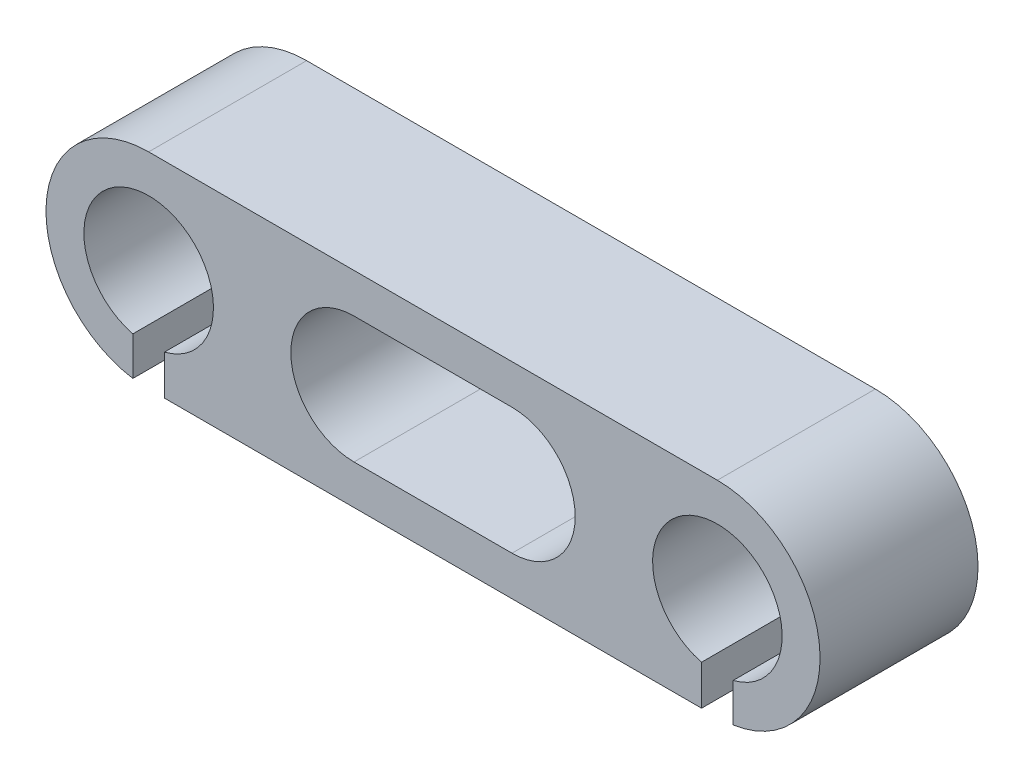
ISO-10303-21;
HEADER;
FILE_DESCRIPTION(('STEP AP214'),'2;1');
FILE_NAME('part.step','',(''),(''),'','','');
FILE_SCHEMA(('AUTOMOTIVE_DESIGN { 1 0 10303 214 1 1 1 1 }'));
ENDSEC;
DATA;
#1=APPLICATION_CONTEXT('core data for automotive mechanical design processes');
#2=APPLICATION_PROTOCOL_DEFINITION('international standard','automotive_design',2000,#1);
#3=PRODUCT_CONTEXT('',#1,'mechanical');
#4=PRODUCT('Part','Part','',(#3));
#5=PRODUCT_RELATED_PRODUCT_CATEGORY('part','',(#4));
#6=PRODUCT_DEFINITION_FORMATION('','',#4);
#7=PRODUCT_DEFINITION_CONTEXT('part definition',#1,'design');
#8=PRODUCT_DEFINITION('design','',#6,#7);
#9=PRODUCT_DEFINITION_SHAPE('','',#8);
#10=(LENGTH_UNIT() NAMED_UNIT(*) SI_UNIT(.MILLI.,.METRE.));
#11=(NAMED_UNIT(*) PLANE_ANGLE_UNIT() SI_UNIT($,.RADIAN.));
#12=(NAMED_UNIT(*) SI_UNIT($,.STERADIAN.) SOLID_ANGLE_UNIT());
#13=UNCERTAINTY_MEASURE_WITH_UNIT(LENGTH_MEASURE(1.E-05),#10,'distance_accuracy_value','');
#14=(GEOMETRIC_REPRESENTATION_CONTEXT(3) GLOBAL_UNCERTAINTY_ASSIGNED_CONTEXT((#13)) GLOBAL_UNIT_ASSIGNED_CONTEXT((#10,
#11,#12)) REPRESENTATION_CONTEXT('',''));
#15=CARTESIAN_POINT('',(0.,0.,0.));
#16=DIRECTION('',(0.,0.,1.));
#17=DIRECTION('',(1.,0.,0.));
#18=AXIS2_PLACEMENT_3D('',#15,#16,#17);
#19=CARTESIAN_POINT('',(18.,0.,5.));
#20=DIRECTION('',(0.,0.,-1.));
#21=DIRECTION('',(-1.,0.,0.));
#22=AXIS2_PLACEMENT_3D('',#19,#20,#21);
#23=CYLINDRICAL_SURFACE('',#22,3.25);
#24=DIRECTION('',(0.,0.,-1.));
#25=VECTOR('',#24,1.);
#26=CARTESIAN_POINT('',(18.5,-3.21130814466628,5.));
#27=LINE('',#26,#25);
#28=CARTESIAN_POINT('',(18.5,-3.21130814466628,0.));
#29=VERTEX_POINT('',#28);
#30=CARTESIAN_POINT('',(18.5,-3.21130814466628,5.));
#31=VERTEX_POINT('',#30);
#32=EDGE_CURVE('E397',#29,#31,#27,.F.);
#33=ORIENTED_EDGE('',*,*,#32,.F.);
#34=CARTESIAN_POINT('',(18.,0.,0.));
#35=DIRECTION('',(0.,0.,1.));
#36=DIRECTION('',(1.,0.,0.));
#37=AXIS2_PLACEMENT_3D('',#34,#35,#36);
#38=CIRCLE('',#37,3.25);
#39=CARTESIAN_POINT('',(18.,3.25,0.));
#40=VERTEX_POINT('',#39);
#41=EDGE_CURVE('E155',#29,#40,#38,.T.);
#42=ORIENTED_EDGE('',*,*,#41,.T.);
#43=DIRECTION('',(0.,0.,-1.));
#44=VECTOR('',#43,1.);
#45=CARTESIAN_POINT('',(18.,3.25,5.));
#46=LINE('',#45,#44);
#47=CARTESIAN_POINT('',(18.,3.25,5.));
#48=VERTEX_POINT('',#47);
#49=EDGE_CURVE('E170',#48,#40,#46,.T.);
#50=ORIENTED_EDGE('',*,*,#49,.F.);
#51=CARTESIAN_POINT('',(18.,0.,5.));
#52=DIRECTION('',(0.,0.,1.));
#53=DIRECTION('',(1.,0.,0.));
#54=AXIS2_PLACEMENT_3D('',#51,#52,#53);
#55=CIRCLE('',#54,3.25);
#56=EDGE_CURVE('E202',#31,#48,#55,.T.);
#57=ORIENTED_EDGE('',*,*,#56,.F.);
#58=EDGE_LOOP('',(#33,#42,#50,#57));
#59=FACE_BOUND('',#58,.T.);
#60=ADVANCED_FACE('F33',(#59),#23,.T.);
#61=CARTESIAN_POINT('',(0.,-3.25,5.));
#62=DIRECTION('',(0.,1.,0.));
#63=DIRECTION('',(-1.,0.,0.));
#64=AXIS2_PLACEMENT_3D('',#61,#62,#63);
#65=PLANE('',#64);
#66=DIRECTION('',(1.,0.,0.));
#67=VECTOR('',#66,1.);
#68=CARTESIAN_POINT('',(0.,-3.25,0.));
#69=LINE('',#68,#67);
#70=CARTESIAN_POINT('',(0.5,-3.25,0.));
#71=VERTEX_POINT('',#70);
#72=CARTESIAN_POINT('',(17.5,-3.25,0.));
#73=VERTEX_POINT('',#72);
#74=EDGE_CURVE('E146',#71,#73,#69,.T.);
#75=ORIENTED_EDGE('',*,*,#74,.T.);
#76=DIRECTION('',(0.,0.,-1.));
#77=VECTOR('',#76,1.);
#78=CARTESIAN_POINT('',(17.5,-3.25,5.));
#79=LINE('',#78,#77);
#80=CARTESIAN_POINT('',(17.5,-3.25,5.));
#81=VERTEX_POINT('',#80);
#82=EDGE_CURVE('E131',#81,#73,#79,.T.);
#83=ORIENTED_EDGE('',*,*,#82,.F.);
#84=DIRECTION('',(1.,0.,0.));
#85=VECTOR('',#84,1.);
#86=CARTESIAN_POINT('',(0.,-3.25,5.));
#87=LINE('',#86,#85);
#88=CARTESIAN_POINT('',(0.5,-3.25,5.));
#89=VERTEX_POINT('',#88);
#90=EDGE_CURVE('E200',#89,#81,#87,.T.);
#91=ORIENTED_EDGE('',*,*,#90,.F.);
#92=DIRECTION('',(0.,0.,-1.));
#93=VECTOR('',#92,1.);
#94=CARTESIAN_POINT('',(0.5,-3.25,5.));
#95=LINE('',#94,#93);
#96=EDGE_CURVE('E154',#89,#71,#95,.T.);
#97=ORIENTED_EDGE('',*,*,#96,.T.);
#98=EDGE_LOOP('',(#75,#83,#91,#97));
#99=FACE_BOUND('',#98,.T.);
#100=ADVANCED_FACE('F153',(#99),#65,.F.);
#101=CARTESIAN_POINT('',(0.,0.,5.));
#102=DIRECTION('',(0.,0.,1.));
#103=DIRECTION('',(1.,0.,0.));
#104=AXIS2_PLACEMENT_3D('',#101,#102,#103);
#105=PLANE('',#104);
#106=DIRECTION('',(0.,-1.,0.));
#107=VECTOR('',#106,1.);
#108=CARTESIAN_POINT('',(17.5,-1.25,5.));
#109=LINE('',#108,#107);
#110=CARTESIAN_POINT('',(17.5,-1.9880895352071,5.));
#111=VERTEX_POINT('',#110);
#112=EDGE_CURVE('E134',#111,#81,#109,.T.);
#113=ORIENTED_EDGE('',*,*,#112,.F.);
#114=CARTESIAN_POINT('',(18.,0.,5.));
#115=DIRECTION('',(0.,0.,1.));
#116=DIRECTION('',(1.,0.,0.));
#117=AXIS2_PLACEMENT_3D('',#114,#115,#116);
#118=CIRCLE('',#117,2.05);
#119=CARTESIAN_POINT('',(18.5,-1.9880895352071,5.));
#120=VERTEX_POINT('',#119);
#121=EDGE_CURVE('E182',#120,#111,#118,.T.);
#122=ORIENTED_EDGE('',*,*,#121,.F.);
#123=DIRECTION('',(0.,-1.,0.));
#124=VECTOR('',#123,1.);
#125=CARTESIAN_POINT('',(18.5,-1.25,5.));
#126=LINE('',#125,#124);
#127=EDGE_CURVE('E55',#120,#31,#126,.T.);
#128=ORIENTED_EDGE('',*,*,#127,.T.);
#129=ORIENTED_EDGE('',*,*,#56,.T.);
#130=DIRECTION('',(-1.,0.,0.));
#131=VECTOR('',#130,1.);
#132=CARTESIAN_POINT('',(0.,3.25,5.));
#133=LINE('',#132,#131);
#134=CARTESIAN_POINT('',(0.,3.25,5.));
#135=VERTEX_POINT('',#134);
#136=EDGE_CURVE('E171',#48,#135,#133,.T.);
#137=ORIENTED_EDGE('',*,*,#136,.T.);
#138=CARTESIAN_POINT('',(0.,0.,5.));
#139=DIRECTION('',(0.,0.,1.));
#140=DIRECTION('',(1.,0.,0.));
#141=AXIS2_PLACEMENT_3D('',#138,#139,#140);
#142=CIRCLE('',#141,3.25);
#143=CARTESIAN_POINT('',(-0.5,-3.21130814466628,5.));
#144=VERTEX_POINT('',#143);
#145=EDGE_CURVE('E166',#135,#144,#142,.T.);
#146=ORIENTED_EDGE('',*,*,#145,.T.);
#147=DIRECTION('',(0.,-1.,0.));
#148=VECTOR('',#147,1.);
#149=CARTESIAN_POINT('',(-0.5,-1.25,5.));
#150=LINE('',#149,#148);
#151=CARTESIAN_POINT('',(-0.5,-1.9880895352071,5.));
#152=VERTEX_POINT('',#151);
#153=EDGE_CURVE('E218',#152,#144,#150,.T.);
#154=ORIENTED_EDGE('',*,*,#153,.F.);
#155=CARTESIAN_POINT('',(0.,0.,5.));
#156=DIRECTION('',(0.,0.,1.));
#157=DIRECTION('',(1.,0.,0.));
#158=AXIS2_PLACEMENT_3D('',#155,#156,#157);
#159=CIRCLE('',#158,2.05);
#160=CARTESIAN_POINT('',(0.5,-1.9880895352071,5.));
#161=VERTEX_POINT('',#160);
#162=EDGE_CURVE('E161',#161,#152,#159,.T.);
#163=ORIENTED_EDGE('',*,*,#162,.F.);
#164=DIRECTION('',(0.,-1.,0.));
#165=VECTOR('',#164,1.);
#166=CARTESIAN_POINT('',(0.5,-1.25,5.));
#167=LINE('',#166,#165);
#168=EDGE_CURVE('E223',#161,#89,#167,.T.);
#169=ORIENTED_EDGE('',*,*,#168,.T.);
#170=ORIENTED_EDGE('',*,*,#90,.T.);
#171=EDGE_LOOP('',(#113,#122,#128,#129,#137,#146,#154,#163,#169,#170));
#172=FACE_BOUND('',#171,.T.);
#173=DIRECTION('',(-1.,0.,0.));
#174=VECTOR('',#173,1.);
#175=CARTESIAN_POINT('',(11.5,2.,5.));
#176=LINE('',#175,#174);
#177=CARTESIAN_POINT('',(11.5,2.,5.));
#178=VERTEX_POINT('',#177);
#179=CARTESIAN_POINT('',(6.5,2.,5.));
#180=VERTEX_POINT('',#179);
#181=EDGE_CURVE('E231',#178,#180,#176,.T.);
#182=ORIENTED_EDGE('',*,*,#181,.F.);
#183=CARTESIAN_POINT('',(11.5,0.,5.));
#184=DIRECTION('',(0.,0.,1.));
#185=DIRECTION('',(1.,0.,0.));
#186=AXIS2_PLACEMENT_3D('',#183,#184,#185);
#187=CIRCLE('',#186,2.);
#188=CARTESIAN_POINT('',(11.5,-2.,5.));
#189=VERTEX_POINT('',#188);
#190=EDGE_CURVE('E229',#189,#178,#187,.T.);
#191=ORIENTED_EDGE('',*,*,#190,.F.);
#192=DIRECTION('',(1.,0.,0.));
#193=VECTOR('',#192,1.);
#194=CARTESIAN_POINT('',(11.5,-2.,5.));
#195=LINE('',#194,#193);
#196=CARTESIAN_POINT('',(6.5,-2.,5.));
#197=VERTEX_POINT('',#196);
#198=EDGE_CURVE('E237',#197,#189,#195,.T.);
#199=ORIENTED_EDGE('',*,*,#198,.F.);
#200=CARTESIAN_POINT('',(6.5,0.,5.));
#201=DIRECTION('',(0.,0.,1.));
#202=DIRECTION('',(1.,0.,0.));
#203=AXIS2_PLACEMENT_3D('',#200,#201,#202);
#204=CIRCLE('',#203,2.);
#205=EDGE_CURVE('E234',#180,#197,#204,.T.);
#206=ORIENTED_EDGE('',*,*,#205,.F.);
#207=EDGE_LOOP('',(#182,#191,#199,#206));
#208=FACE_BOUND('',#207,.T.);
#209=ADVANCED_FACE('F184',(#172,#208),#105,.T.);
#210=CARTESIAN_POINT('',(0.,0.,0.));
#211=DIRECTION('',(0.,0.,1.));
#212=DIRECTION('',(1.,0.,0.));
#213=AXIS2_PLACEMENT_3D('',#210,#211,#212);
#214=PLANE('',#213);
#215=CARTESIAN_POINT('',(18.,0.,0.));
#216=DIRECTION('',(0.,0.,1.));
#217=DIRECTION('',(1.,0.,0.));
#218=AXIS2_PLACEMENT_3D('',#215,#216,#217);
#219=CIRCLE('',#218,2.05);
#220=CARTESIAN_POINT('',(18.5,-1.9880895352071,0.));
#221=VERTEX_POINT('',#220);
#222=CARTESIAN_POINT('',(17.5,-1.9880895352071,0.));
#223=VERTEX_POINT('',#222);
#224=EDGE_CURVE('E149',#221,#223,#219,.T.);
#225=ORIENTED_EDGE('',*,*,#224,.T.);
#226=DIRECTION('',(0.,-1.,0.));
#227=VECTOR('',#226,1.);
#228=CARTESIAN_POINT('',(17.5,-1.25,0.));
#229=LINE('',#228,#227);
#230=EDGE_CURVE('E47',#223,#73,#229,.T.);
#231=ORIENTED_EDGE('',*,*,#230,.T.);
#232=ORIENTED_EDGE('',*,*,#74,.F.);
#233=DIRECTION('',(0.,-1.,0.));
#234=VECTOR('',#233,1.);
#235=CARTESIAN_POINT('',(0.5,-1.25,0.));
#236=LINE('',#235,#234);
#237=CARTESIAN_POINT('',(0.5,-1.9880895352071,0.));
#238=VERTEX_POINT('',#237);
#239=EDGE_CURVE('E405',#238,#71,#236,.T.);
#240=ORIENTED_EDGE('',*,*,#239,.F.);
#241=CARTESIAN_POINT('',(0.,0.,0.));
#242=DIRECTION('',(0.,0.,1.));
#243=DIRECTION('',(1.,0.,0.));
#244=AXIS2_PLACEMENT_3D('',#241,#242,#243);
#245=CIRCLE('',#244,2.05);
#246=CARTESIAN_POINT('',(-0.5,-1.9880895352071,0.));
#247=VERTEX_POINT('',#246);
#248=EDGE_CURVE('E187',#238,#247,#245,.T.);
#249=ORIENTED_EDGE('',*,*,#248,.T.);
#250=DIRECTION('',(0.,-1.,0.));
#251=VECTOR('',#250,1.);
#252=CARTESIAN_POINT('',(-0.5,-1.25,0.));
#253=LINE('',#252,#251);
#254=CARTESIAN_POINT('',(-0.5,-3.21130814466628,0.));
#255=VERTEX_POINT('',#254);
#256=EDGE_CURVE('E227',#247,#255,#253,.T.);
#257=ORIENTED_EDGE('',*,*,#256,.T.);
#258=CARTESIAN_POINT('',(0.,0.,0.));
#259=DIRECTION('',(0.,0.,1.));
#260=DIRECTION('',(1.,0.,0.));
#261=AXIS2_PLACEMENT_3D('',#258,#259,#260);
#262=CIRCLE('',#261,3.25);
#263=CARTESIAN_POINT('',(0.,3.25,0.));
#264=VERTEX_POINT('',#263);
#265=EDGE_CURVE('E156',#264,#255,#262,.T.);
#266=ORIENTED_EDGE('',*,*,#265,.F.);
#267=DIRECTION('',(-1.,0.,0.));
#268=VECTOR('',#267,1.);
#269=CARTESIAN_POINT('',(0.,3.25,0.));
#270=LINE('',#269,#268);
#271=EDGE_CURVE('E158',#40,#264,#270,.T.);
#272=ORIENTED_EDGE('',*,*,#271,.F.);
#273=ORIENTED_EDGE('',*,*,#41,.F.);
#274=DIRECTION('',(0.,-1.,0.));
#275=VECTOR('',#274,1.);
#276=CARTESIAN_POINT('',(18.5,-1.25,0.));
#277=LINE('',#276,#275);
#278=EDGE_CURVE('E150',#221,#29,#277,.T.);
#279=ORIENTED_EDGE('',*,*,#278,.F.);
#280=EDGE_LOOP('',(#225,#231,#232,#240,#249,#257,#266,#272,#273,#279));
#281=FACE_BOUND('',#280,.T.);
#282=CARTESIAN_POINT('',(11.5,0.,0.));
#283=DIRECTION('',(0.,0.,1.));
#284=DIRECTION('',(1.,0.,0.));
#285=AXIS2_PLACEMENT_3D('',#282,#283,#284);
#286=CIRCLE('',#285,2.);
#287=CARTESIAN_POINT('',(11.5,-2.,0.));
#288=VERTEX_POINT('',#287);
#289=CARTESIAN_POINT('',(11.5,2.,0.));
#290=VERTEX_POINT('',#289);
#291=EDGE_CURVE('E217',#288,#290,#286,.T.);
#292=ORIENTED_EDGE('',*,*,#291,.T.);
#293=DIRECTION('',(-1.,0.,0.));
#294=VECTOR('',#293,1.);
#295=CARTESIAN_POINT('',(11.5,2.,0.));
#296=LINE('',#295,#294);
#297=CARTESIAN_POINT('',(6.5,2.,0.));
#298=VERTEX_POINT('',#297);
#299=EDGE_CURVE('E221',#290,#298,#296,.T.);
#300=ORIENTED_EDGE('',*,*,#299,.T.);
#301=CARTESIAN_POINT('',(6.5,0.,0.));
#302=DIRECTION('',(0.,0.,1.));
#303=DIRECTION('',(1.,0.,0.));
#304=AXIS2_PLACEMENT_3D('',#301,#302,#303);
#305=CIRCLE('',#304,2.);
#306=CARTESIAN_POINT('',(6.5,-2.,0.));
#307=VERTEX_POINT('',#306);
#308=EDGE_CURVE('E242',#298,#307,#305,.T.);
#309=ORIENTED_EDGE('',*,*,#308,.T.);
#310=DIRECTION('',(1.,0.,0.));
#311=VECTOR('',#310,1.);
#312=CARTESIAN_POINT('',(11.5,-2.,0.));
#313=LINE('',#312,#311);
#314=EDGE_CURVE('E232',#307,#288,#313,.T.);
#315=ORIENTED_EDGE('',*,*,#314,.T.);
#316=EDGE_LOOP('',(#292,#300,#309,#315));
#317=FACE_BOUND('',#316,.T.);
#318=ADVANCED_FACE('F143',(#281,#317),#214,.F.);
#319=CARTESIAN_POINT('',(0.,0.,5.));
#320=DIRECTION('',(0.,0.,-1.));
#321=DIRECTION('',(-1.,0.,0.));
#322=AXIS2_PLACEMENT_3D('',#319,#320,#321);
#323=CYLINDRICAL_SURFACE('',#322,3.25);
#324=ORIENTED_EDGE('',*,*,#265,.T.);
#325=DIRECTION('',(0.,0.,-1.));
#326=VECTOR('',#325,1.);
#327=CARTESIAN_POINT('',(-0.5,-3.21130814466628,5.));
#328=LINE('',#327,#326);
#329=EDGE_CURVE('E214',#255,#144,#328,.F.);
#330=ORIENTED_EDGE('',*,*,#329,.T.);
#331=ORIENTED_EDGE('',*,*,#145,.F.);
#332=DIRECTION('',(0.,0.,-1.));
#333=VECTOR('',#332,1.);
#334=CARTESIAN_POINT('',(0.,3.25,5.));
#335=LINE('',#334,#333);
#336=EDGE_CURVE('E167',#135,#264,#335,.T.);
#337=ORIENTED_EDGE('',*,*,#336,.T.);
#338=EDGE_LOOP('',(#324,#330,#331,#337));
#339=FACE_BOUND('',#338,.T.);
#340=ADVANCED_FACE('F35',(#339),#323,.T.);
#341=CARTESIAN_POINT('',(0.,3.25,5.));
#342=DIRECTION('',(0.,-1.,0.));
#343=DIRECTION('',(1.,0.,0.));
#344=AXIS2_PLACEMENT_3D('',#341,#342,#343);
#345=PLANE('',#344);
#346=ORIENTED_EDGE('',*,*,#271,.T.);
#347=ORIENTED_EDGE('',*,*,#336,.F.);
#348=ORIENTED_EDGE('',*,*,#136,.F.);
#349=ORIENTED_EDGE('',*,*,#49,.T.);
#350=EDGE_LOOP('',(#346,#347,#348,#349));
#351=FACE_BOUND('',#350,.T.);
#352=ADVANCED_FACE('F209',(#351),#345,.F.);
#353=CARTESIAN_POINT('',(0.,0.,5.));
#354=DIRECTION('',(0.,0.,-1.));
#355=DIRECTION('',(-1.,0.,0.));
#356=AXIS2_PLACEMENT_3D('',#353,#354,#355);
#357=CYLINDRICAL_SURFACE('',#356,2.05);
#358=DIRECTION('',(0.,0.,-1.));
#359=VECTOR('',#358,1.);
#360=CARTESIAN_POINT('',(-0.5,-1.9880895352071,5.));
#361=LINE('',#360,#359);
#362=EDGE_CURVE('E177',#247,#152,#361,.F.);
#363=ORIENTED_EDGE('',*,*,#362,.F.);
#364=ORIENTED_EDGE('',*,*,#248,.F.);
#365=DIRECTION('',(0.,0.,-1.));
#366=VECTOR('',#365,1.);
#367=CARTESIAN_POINT('',(0.5,-1.9880895352071,5.));
#368=LINE('',#367,#366);
#369=EDGE_CURVE('E174',#238,#161,#368,.F.);
#370=ORIENTED_EDGE('',*,*,#369,.T.);
#371=ORIENTED_EDGE('',*,*,#162,.T.);
#372=EDGE_LOOP('',(#363,#364,#370,#371));
#373=FACE_BOUND('',#372,.T.);
#374=ADVANCED_FACE('F288',(#373),#357,.F.);
#375=CARTESIAN_POINT('',(18.,0.,5.));
#376=DIRECTION('',(0.,0.,-1.));
#377=DIRECTION('',(-1.,0.,0.));
#378=AXIS2_PLACEMENT_3D('',#375,#376,#377);
#379=CYLINDRICAL_SURFACE('',#378,2.05);
#380=DIRECTION('',(0.,0.,-1.));
#381=VECTOR('',#380,1.);
#382=CARTESIAN_POINT('',(17.5,-1.9880895352071,5.));
#383=LINE('',#382,#381);
#384=EDGE_CURVE('E11',#223,#111,#383,.F.);
#385=ORIENTED_EDGE('',*,*,#384,.F.);
#386=ORIENTED_EDGE('',*,*,#224,.F.);
#387=DIRECTION('',(0.,0.,-1.));
#388=VECTOR('',#387,1.);
#389=CARTESIAN_POINT('',(18.5,-1.9880895352071,5.));
#390=LINE('',#389,#388);
#391=EDGE_CURVE('E41',#221,#120,#390,.F.);
#392=ORIENTED_EDGE('',*,*,#391,.T.);
#393=ORIENTED_EDGE('',*,*,#121,.T.);
#394=EDGE_LOOP('',(#385,#386,#392,#393));
#395=FACE_BOUND('',#394,.T.);
#396=ADVANCED_FACE('F181',(#395),#379,.F.);
#397=CARTESIAN_POINT('',(11.5,0.,5.));
#398=DIRECTION('',(0.,0.,-1.));
#399=DIRECTION('',(-1.,0.,0.));
#400=AXIS2_PLACEMENT_3D('',#397,#398,#399);
#401=CYLINDRICAL_SURFACE('',#400,2.);
#402=ORIENTED_EDGE('',*,*,#291,.F.);
#403=DIRECTION('',(0.,0.,-1.));
#404=VECTOR('',#403,1.);
#405=CARTESIAN_POINT('',(11.5,-2.,5.));
#406=LINE('',#405,#404);
#407=EDGE_CURVE('E238',#189,#288,#406,.T.);
#408=ORIENTED_EDGE('',*,*,#407,.F.);
#409=ORIENTED_EDGE('',*,*,#190,.T.);
#410=DIRECTION('',(0.,0.,-1.));
#411=VECTOR('',#410,1.);
#412=CARTESIAN_POINT('',(11.5,2.,5.));
#413=LINE('',#412,#411);
#414=EDGE_CURVE('E191',#178,#290,#413,.T.);
#415=ORIENTED_EDGE('',*,*,#414,.T.);
#416=EDGE_LOOP('',(#402,#408,#409,#415));
#417=FACE_BOUND('',#416,.T.);
#418=ADVANCED_FACE('F257',(#417),#401,.F.);
#419=CARTESIAN_POINT('',(11.5,2.,5.));
#420=DIRECTION('',(0.,-1.,0.));
#421=DIRECTION('',(1.,0.,0.));
#422=AXIS2_PLACEMENT_3D('',#419,#420,#421);
#423=PLANE('',#422);
#424=ORIENTED_EDGE('',*,*,#299,.F.);
#425=ORIENTED_EDGE('',*,*,#414,.F.);
#426=ORIENTED_EDGE('',*,*,#181,.T.);
#427=DIRECTION('',(0.,0.,-1.));
#428=VECTOR('',#427,1.);
#429=CARTESIAN_POINT('',(6.5,2.,5.));
#430=LINE('',#429,#428);
#431=EDGE_CURVE('E250',#180,#298,#430,.T.);
#432=ORIENTED_EDGE('',*,*,#431,.T.);
#433=EDGE_LOOP('',(#424,#425,#426,#432));
#434=FACE_BOUND('',#433,.T.);
#435=ADVANCED_FACE('F266',(#434),#423,.T.);
#436=CARTESIAN_POINT('',(6.5,0.,5.));
#437=DIRECTION('',(0.,0.,-1.));
#438=DIRECTION('',(-1.,0.,0.));
#439=AXIS2_PLACEMENT_3D('',#436,#437,#438);
#440=CYLINDRICAL_SURFACE('',#439,2.);
#441=ORIENTED_EDGE('',*,*,#308,.F.);
#442=ORIENTED_EDGE('',*,*,#431,.F.);
#443=ORIENTED_EDGE('',*,*,#205,.T.);
#444=DIRECTION('',(0.,0.,-1.));
#445=VECTOR('',#444,1.);
#446=CARTESIAN_POINT('',(6.5,-2.,5.));
#447=LINE('',#446,#445);
#448=EDGE_CURVE('E249',#197,#307,#447,.T.);
#449=ORIENTED_EDGE('',*,*,#448,.T.);
#450=EDGE_LOOP('',(#441,#442,#443,#449));
#451=FACE_BOUND('',#450,.T.);
#452=ADVANCED_FACE('F268',(#451),#440,.F.);
#453=CARTESIAN_POINT('',(11.5,-2.,5.));
#454=DIRECTION('',(0.,1.,0.));
#455=DIRECTION('',(-1.,0.,0.));
#456=AXIS2_PLACEMENT_3D('',#453,#454,#455);
#457=PLANE('',#456);
#458=ORIENTED_EDGE('',*,*,#314,.F.);
#459=ORIENTED_EDGE('',*,*,#448,.F.);
#460=ORIENTED_EDGE('',*,*,#198,.T.);
#461=ORIENTED_EDGE('',*,*,#407,.T.);
#462=EDGE_LOOP('',(#458,#459,#460,#461));
#463=FACE_BOUND('',#462,.T.);
#464=ADVANCED_FACE('F263',(#463),#457,.T.);
#465=CARTESIAN_POINT('',(0.5,-1.25,5.));
#466=DIRECTION('',(-1.,0.,0.));
#467=DIRECTION('',(0.,-1.,0.));
#468=AXIS2_PLACEMENT_3D('',#465,#466,#467);
#469=PLANE('',#468);
#470=ORIENTED_EDGE('',*,*,#239,.T.);
#471=ORIENTED_EDGE('',*,*,#96,.F.);
#472=ORIENTED_EDGE('',*,*,#168,.F.);
#473=ORIENTED_EDGE('',*,*,#369,.F.);
#474=EDGE_LOOP('',(#470,#471,#472,#473));
#475=FACE_BOUND('',#474,.T.);
#476=ADVANCED_FACE('F275',(#475),#469,.T.);
#477=CARTESIAN_POINT('',(-0.5,-1.25,5.));
#478=DIRECTION('',(-1.,0.,0.));
#479=DIRECTION('',(0.,-1.,0.));
#480=AXIS2_PLACEMENT_3D('',#477,#478,#479);
#481=PLANE('',#480);
#482=ORIENTED_EDGE('',*,*,#256,.F.);
#483=ORIENTED_EDGE('',*,*,#362,.T.);
#484=ORIENTED_EDGE('',*,*,#153,.T.);
#485=ORIENTED_EDGE('',*,*,#329,.F.);
#486=EDGE_LOOP('',(#482,#483,#484,#485));
#487=FACE_BOUND('',#486,.T.);
#488=ADVANCED_FACE('F367',(#487),#481,.F.);
#489=CARTESIAN_POINT('',(18.5,-1.25,5.));
#490=DIRECTION('',(-1.,0.,0.));
#491=DIRECTION('',(0.,-1.,0.));
#492=AXIS2_PLACEMENT_3D('',#489,#490,#491);
#493=PLANE('',#492);
#494=ORIENTED_EDGE('',*,*,#32,.T.);
#495=ORIENTED_EDGE('',*,*,#127,.F.);
#496=ORIENTED_EDGE('',*,*,#391,.F.);
#497=ORIENTED_EDGE('',*,*,#278,.T.);
#498=EDGE_LOOP('',(#494,#495,#496,#497));
#499=FACE_BOUND('',#498,.T.);
#500=ADVANCED_FACE('F377',(#499),#493,.T.);
#501=CARTESIAN_POINT('',(17.5,-1.25,5.));
#502=DIRECTION('',(-1.,0.,0.));
#503=DIRECTION('',(0.,-1.,0.));
#504=AXIS2_PLACEMENT_3D('',#501,#502,#503);
#505=PLANE('',#504);
#506=ORIENTED_EDGE('',*,*,#384,.T.);
#507=ORIENTED_EDGE('',*,*,#112,.T.);
#508=ORIENTED_EDGE('',*,*,#82,.T.);
#509=ORIENTED_EDGE('',*,*,#230,.F.);
#510=EDGE_LOOP('',(#506,#507,#508,#509));
#511=FACE_BOUND('',#510,.T.);
#512=ADVANCED_FACE('F132',(#511),#505,.F.);
#513=CLOSED_SHELL('',(#60,#100,#209,#318,#340,#352,#374,#396,#418,#435,#452,#464,#476,#488,#500,#512));
#514=MANIFOLD_SOLID_BREP('B2',#513);
#515=ADVANCED_BREP_SHAPE_REPRESENTATION('',(#18,#514),#14);
#516=SHAPE_DEFINITION_REPRESENTATION(#9,#515);
ENDSEC;
END-ISO-10303-21;
